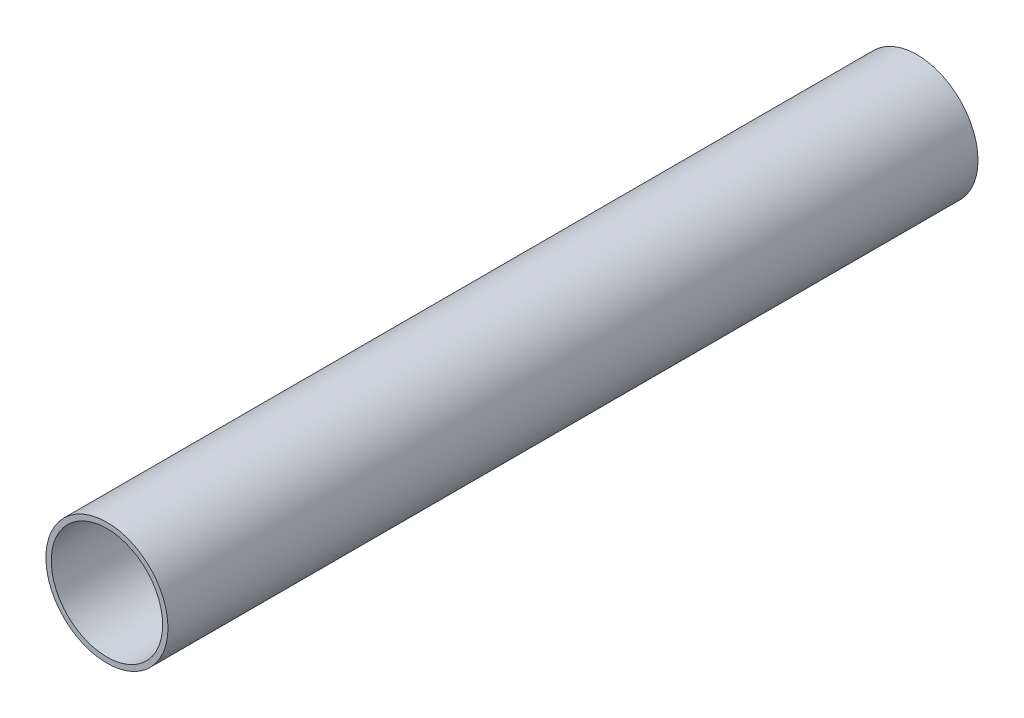
ISO-10303-21;
HEADER;
FILE_DESCRIPTION(('STEP AP214'),'2;1');
FILE_NAME('part.step','',(''),(''),'','','');
FILE_SCHEMA(('AUTOMOTIVE_DESIGN { 1 0 10303 214 1 1 1 1 }'));
ENDSEC;
DATA;
#1=APPLICATION_CONTEXT('core data for automotive mechanical design processes');
#2=APPLICATION_PROTOCOL_DEFINITION('international standard','automotive_design',2000,#1);
#3=PRODUCT_CONTEXT('',#1,'mechanical');
#4=PRODUCT('Part','Part','',(#3));
#5=PRODUCT_RELATED_PRODUCT_CATEGORY('part','',(#4));
#6=PRODUCT_DEFINITION_FORMATION('','',#4);
#7=PRODUCT_DEFINITION_CONTEXT('part definition',#1,'design');
#8=PRODUCT_DEFINITION('design','',#6,#7);
#9=PRODUCT_DEFINITION_SHAPE('','',#8);
#10=(LENGTH_UNIT() NAMED_UNIT(*) SI_UNIT(.MILLI.,.METRE.));
#11=(NAMED_UNIT(*) PLANE_ANGLE_UNIT() SI_UNIT($,.RADIAN.));
#12=(NAMED_UNIT(*) SI_UNIT($,.STERADIAN.) SOLID_ANGLE_UNIT());
#13=UNCERTAINTY_MEASURE_WITH_UNIT(LENGTH_MEASURE(1.E-05),#10,'distance_accuracy_value','');
#14=(GEOMETRIC_REPRESENTATION_CONTEXT(3) GLOBAL_UNCERTAINTY_ASSIGNED_CONTEXT((#13)) GLOBAL_UNIT_ASSIGNED_CONTEXT((#10,
#11,#12)) REPRESENTATION_CONTEXT('',''));
#15=CARTESIAN_POINT('',(0.,0.,0.));
#16=DIRECTION('',(0.,0.,1.));
#17=DIRECTION('',(1.,0.,0.));
#18=AXIS2_PLACEMENT_3D('',#15,#16,#17);
#19=CARTESIAN_POINT('',(0.,0.,400.));
#20=DIRECTION('',(0.,0.,1.));
#21=DIRECTION('',(1.,0.,0.));
#22=AXIS2_PLACEMENT_3D('',#19,#20,#21);
#23=PLANE('',#22);
#24=CARTESIAN_POINT('',(0.,0.,400.));
#25=DIRECTION('',(0.,0.,1.));
#26=DIRECTION('',(1.,0.,0.));
#27=AXIS2_PLACEMENT_3D('',#24,#25,#26);
#28=CIRCLE('',#27,30.15);
#29=CARTESIAN_POINT('',(30.15,0.,400.));
#30=VERTEX_POINT('',#29);
#31=EDGE_CURVE('E10',#30,#30,#28,.T.);
#32=ORIENTED_EDGE('',*,*,#31,.T.);
#33=EDGE_LOOP('',(#32));
#34=FACE_BOUND('',#33,.T.);
#35=CARTESIAN_POINT('',(0.,0.,400.));
#36=DIRECTION('',(0.,0.,1.));
#37=DIRECTION('',(1.,0.,0.));
#38=AXIS2_PLACEMENT_3D('',#35,#36,#37);
#39=CIRCLE('',#38,27.5);
#40=CARTESIAN_POINT('',(27.5,0.,400.));
#41=VERTEX_POINT('',#40);
#42=EDGE_CURVE('E50',#41,#41,#39,.T.);
#43=ORIENTED_EDGE('',*,*,#42,.F.);
#44=EDGE_LOOP('',(#43));
#45=FACE_BOUND('',#44,.T.);
#46=ADVANCED_FACE('F37',(#34,#45),#23,.T.);
#47=CARTESIAN_POINT('',(0.,0.,0.));
#48=DIRECTION('',(0.,0.,1.));
#49=DIRECTION('',(1.,0.,0.));
#50=AXIS2_PLACEMENT_3D('',#47,#48,#49);
#51=PLANE('',#50);
#52=CARTESIAN_POINT('',(0.,0.,0.));
#53=DIRECTION('',(0.,0.,1.));
#54=DIRECTION('',(1.,0.,0.));
#55=AXIS2_PLACEMENT_3D('',#52,#53,#54);
#56=CIRCLE('',#55,30.15);
#57=CARTESIAN_POINT('',(30.15,0.,0.));
#58=VERTEX_POINT('',#57);
#59=EDGE_CURVE('E41',#58,#58,#56,.T.);
#60=ORIENTED_EDGE('',*,*,#59,.F.);
#61=EDGE_LOOP('',(#60));
#62=FACE_BOUND('',#61,.T.);
#63=CARTESIAN_POINT('',(0.,0.,0.));
#64=DIRECTION('',(0.,0.,1.));
#65=DIRECTION('',(1.,0.,0.));
#66=AXIS2_PLACEMENT_3D('',#63,#64,#65);
#67=CIRCLE('',#66,27.5);
#68=CARTESIAN_POINT('',(27.5,0.,0.));
#69=VERTEX_POINT('',#68);
#70=EDGE_CURVE('E52',#69,#69,#67,.T.);
#71=ORIENTED_EDGE('',*,*,#70,.T.);
#72=EDGE_LOOP('',(#71));
#73=FACE_BOUND('',#72,.T.);
#74=ADVANCED_FACE('F64',(#62,#73),#51,.F.);
#75=CARTESIAN_POINT('',(0.,0.,400.));
#76=DIRECTION('',(0.,0.,-1.));
#77=DIRECTION('',(-1.,0.,0.));
#78=AXIS2_PLACEMENT_3D('',#75,#76,#77);
#79=CYLINDRICAL_SURFACE('',#78,30.15);
#80=ORIENTED_EDGE('',*,*,#31,.F.);
#81=EDGE_LOOP('',(#80));
#82=FACE_BOUND('',#81,.T.);
#83=ORIENTED_EDGE('',*,*,#59,.T.);
#84=EDGE_LOOP('',(#83));
#85=FACE_BOUND('',#84,.T.);
#86=ADVANCED_FACE('F39',(#82,#85),#79,.T.);
#87=CARTESIAN_POINT('',(0.,0.,400.));
#88=DIRECTION('',(0.,0.,-1.));
#89=DIRECTION('',(-1.,0.,0.));
#90=AXIS2_PLACEMENT_3D('',#87,#88,#89);
#91=CYLINDRICAL_SURFACE('',#90,27.5);
#92=ORIENTED_EDGE('',*,*,#42,.T.);
#93=EDGE_LOOP('',(#92));
#94=FACE_BOUND('',#93,.T.);
#95=ORIENTED_EDGE('',*,*,#70,.F.);
#96=EDGE_LOOP('',(#95));
#97=FACE_BOUND('',#96,.T.);
#98=ADVANCED_FACE('F60',(#94,#97),#91,.F.);
#99=CLOSED_SHELL('',(#46,#74,#86,#98));
#100=MANIFOLD_SOLID_BREP('B2',#99);
#101=ADVANCED_BREP_SHAPE_REPRESENTATION('',(#18,#100),#14);
#102=SHAPE_DEFINITION_REPRESENTATION(#9,#101);
ENDSEC;
END-ISO-10303-21;
